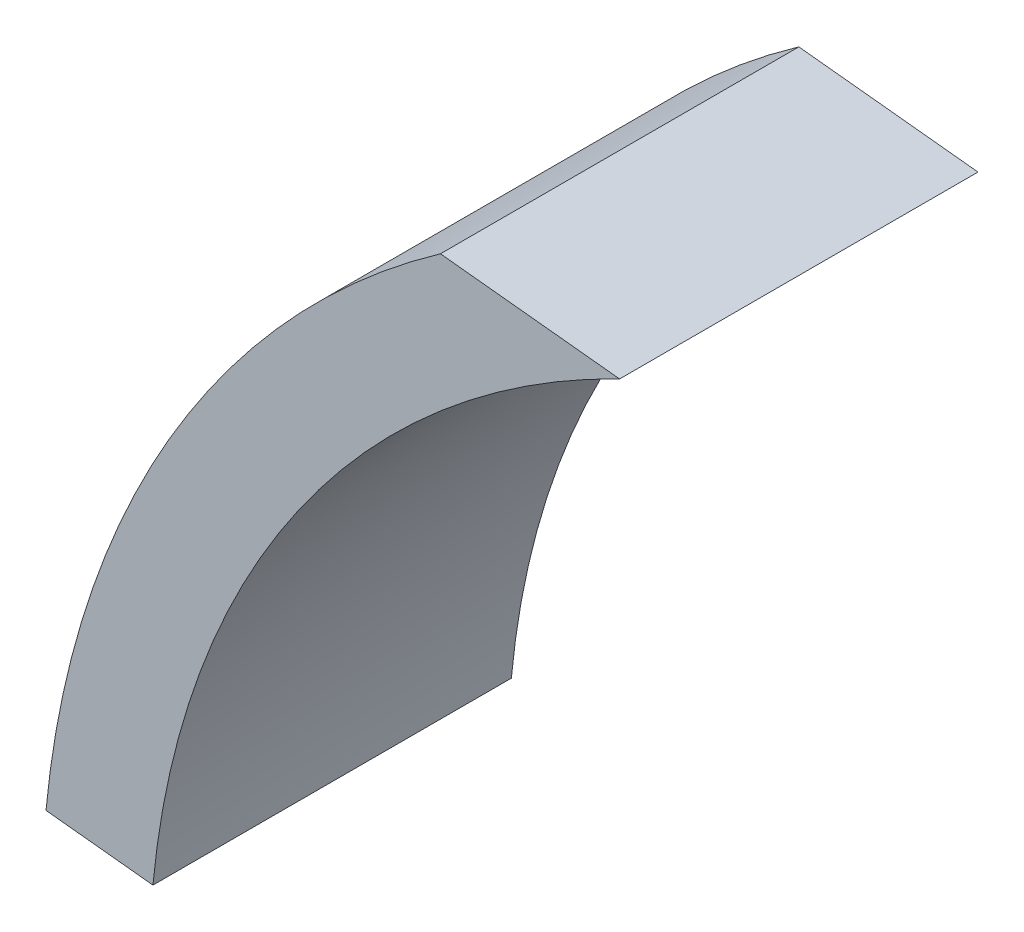
ISO-10303-21;
HEADER;
FILE_DESCRIPTION(('STEP AP214'),'2;1');
FILE_NAME('part.step','',(''),(''),'','','');
FILE_SCHEMA(('AUTOMOTIVE_DESIGN { 1 0 10303 214 1 1 1 1 }'));
ENDSEC;
DATA;
#1=APPLICATION_CONTEXT('core data for automotive mechanical design processes');
#2=APPLICATION_PROTOCOL_DEFINITION('international standard','automotive_design',2000,#1);
#3=PRODUCT_CONTEXT('',#1,'mechanical');
#4=PRODUCT('Part','Part','',(#3));
#5=PRODUCT_RELATED_PRODUCT_CATEGORY('part','',(#4));
#6=PRODUCT_DEFINITION_FORMATION('','',#4);
#7=PRODUCT_DEFINITION_CONTEXT('part definition',#1,'design');
#8=PRODUCT_DEFINITION('design','',#6,#7);
#9=PRODUCT_DEFINITION_SHAPE('','',#8);
#10=(LENGTH_UNIT() NAMED_UNIT(*) SI_UNIT(.MILLI.,.METRE.));
#11=(NAMED_UNIT(*) PLANE_ANGLE_UNIT() SI_UNIT($,.RADIAN.));
#12=(NAMED_UNIT(*) SI_UNIT($,.STERADIAN.) SOLID_ANGLE_UNIT());
#13=UNCERTAINTY_MEASURE_WITH_UNIT(LENGTH_MEASURE(1.E-05),#10,'distance_accuracy_value','');
#14=(GEOMETRIC_REPRESENTATION_CONTEXT(3) GLOBAL_UNCERTAINTY_ASSIGNED_CONTEXT((#13)) GLOBAL_UNIT_ASSIGNED_CONTEXT((#10,
#11,#12)) REPRESENTATION_CONTEXT('',''));
#15=CARTESIAN_POINT('',(0.,0.,0.));
#16=DIRECTION('',(0.,0.,1.));
#17=DIRECTION('',(1.,0.,0.));
#18=AXIS2_PLACEMENT_3D('',#15,#16,#17);
#19=CARTESIAN_POINT('',(0.,0.,6.15));
#20=DIRECTION('',(0.,0.,1.));
#21=DIRECTION('',(1.,0.,0.));
#22=AXIS2_PLACEMENT_3D('',#19,#20,#21);
#23=PLANE('',#22);
#24=DIRECTION('',(0.994521895368273,-0.104528463267654,0.));
#25=VECTOR('',#24,1.);
#26=CARTESIAN_POINT('',(0.826031073261367,7.85916068152122,6.15));
#27=LINE('',#26,#25);
#28=CARTESIAN_POINT('',(-6.04994012159409,8.58185437566532,6.15));
#29=VERTEX_POINT('',#28);
#30=CARTESIAN_POINT('',(-4.05029811740699,8.37168353201012,6.15));
#31=VERTEX_POINT('',#30);
#32=EDGE_CURVE('E50',#29,#31,#27,.T.);
#33=ORIENTED_EDGE('',*,*,#32,.F.);
#34=CARTESIAN_POINT('',(0.,0.,6.15));
#35=DIRECTION('',(0.,0.,1.));
#36=DIRECTION('',(1.,0.,0.));
#37=AXIS2_PLACEMENT_3D('',#34,#35,#36);
#38=CIRCLE('',#37,10.5);
#39=CARTESIAN_POINT('',(-10.452225874404,1.00048701662726,6.15));
#40=VERTEX_POINT('',#39);
#41=EDGE_CURVE('E112',#29,#40,#38,.T.);
#42=ORIENTED_EDGE('',*,*,#41,.T.);
#43=DIRECTION('',(-0.994521895368273,0.104528463267654,0.));
#44=VECTOR('',#43,1.);
#45=CARTESIAN_POINT('',(-0.0101966328798677,-0.0970144814249705,6.15));
#46=LINE('',#45,#44);
#47=CARTESIAN_POINT('',(-9.25874144728863,0.875046748613809,6.15));
#48=VERTEX_POINT('',#47);
#49=EDGE_CURVE('E116',#48,#40,#46,.T.);
#50=ORIENTED_EDGE('',*,*,#49,.F.);
#51=CARTESIAN_POINT('',(0.,0.,6.15));
#52=DIRECTION('',(0.,0.,-1.));
#53=DIRECTION('',(1.,0.,0.));
#54=AXIS2_PLACEMENT_3D('',#51,#52,#53);
#55=CIRCLE('',#54,9.3);
#56=EDGE_CURVE('E89',#48,#31,#55,.T.);
#57=ORIENTED_EDGE('',*,*,#56,.T.);
#58=EDGE_LOOP('',(#33,#42,#50,#57));
#59=FACE_BOUND('',#58,.T.);
#60=ADVANCED_FACE('F41',(#59),#23,.T.);
#61=CARTESIAN_POINT('',(0.,0.,6.15));
#62=DIRECTION('',(0.,0.,-1.));
#63=DIRECTION('',(-1.,0.,0.));
#64=AXIS2_PLACEMENT_3D('',#61,#62,#63);
#65=CYLINDRICAL_SURFACE('',#64,10.5);
#66=ORIENTED_EDGE('',*,*,#41,.F.);
#67=DIRECTION('',(0.,0.,-1.));
#68=VECTOR('',#67,1.);
#69=CARTESIAN_POINT('',(-6.04994012159409,8.58185437566533,6.15));
#70=LINE('',#69,#68);
#71=CARTESIAN_POINT('',(-6.04994012159409,8.58185437566532,2.15));
#72=VERTEX_POINT('',#71);
#73=EDGE_CURVE('E100',#29,#72,#70,.T.);
#74=ORIENTED_EDGE('',*,*,#73,.T.);
#75=CARTESIAN_POINT('',(0.,0.,2.15));
#76=DIRECTION('',(0.,0.,1.));
#77=DIRECTION('',(1.,0.,0.));
#78=AXIS2_PLACEMENT_3D('',#75,#76,#77);
#79=CIRCLE('',#78,10.5);
#80=CARTESIAN_POINT('',(-10.452225874404,1.00048701662726,2.15));
#81=VERTEX_POINT('',#80);
#82=EDGE_CURVE('E11',#72,#81,#79,.T.);
#83=ORIENTED_EDGE('',*,*,#82,.T.);
#84=DIRECTION('',(0.,0.,-1.));
#85=VECTOR('',#84,1.);
#86=CARTESIAN_POINT('',(-10.452225874404,1.00048701662726,6.15));
#87=LINE('',#86,#85);
#88=EDGE_CURVE('E94',#81,#40,#87,.F.);
#89=ORIENTED_EDGE('',*,*,#88,.T.);
#90=EDGE_LOOP('',(#66,#74,#83,#89));
#91=FACE_BOUND('',#90,.T.);
#92=ADVANCED_FACE('F125',(#91),#65,.T.);
#93=CARTESIAN_POINT('',(0.,0.,6.15));
#94=DIRECTION('',(0.,0.,-1.));
#95=DIRECTION('',(-1.,0.,0.));
#96=AXIS2_PLACEMENT_3D('',#93,#94,#95);
#97=CYLINDRICAL_SURFACE('',#96,9.3);
#98=CARTESIAN_POINT('',(0.,0.,2.15));
#99=DIRECTION('',(0.,0.,1.));
#100=DIRECTION('',(1.,0.,0.));
#101=AXIS2_PLACEMENT_3D('',#98,#99,#100);
#102=CIRCLE('',#101,9.3);
#103=CARTESIAN_POINT('',(-9.25874144728863,0.875046748613807,2.15));
#104=VERTEX_POINT('',#103);
#105=CARTESIAN_POINT('',(-4.05029811740699,8.37168353201012,2.15));
#106=VERTEX_POINT('',#105);
#107=EDGE_CURVE('E82',#104,#106,#102,.F.);
#108=ORIENTED_EDGE('',*,*,#107,.T.);
#109=DIRECTION('',(0.,0.,-1.));
#110=VECTOR('',#109,1.);
#111=CARTESIAN_POINT('',(-4.05029811740699,8.37168353201012,6.15));
#112=LINE('',#111,#110);
#113=EDGE_CURVE('E90',#106,#31,#112,.F.);
#114=ORIENTED_EDGE('',*,*,#113,.T.);
#115=ORIENTED_EDGE('',*,*,#56,.F.);
#116=DIRECTION('',(0.,0.,-1.));
#117=VECTOR('',#116,1.);
#118=CARTESIAN_POINT('',(-9.25874144728863,0.875046748613809,6.15));
#119=LINE('',#118,#117);
#120=EDGE_CURVE('E57',#48,#104,#119,.T.);
#121=ORIENTED_EDGE('',*,*,#120,.T.);
#122=EDGE_LOOP('',(#108,#114,#115,#121));
#123=FACE_BOUND('',#122,.T.);
#124=ADVANCED_FACE('F43',(#123),#97,.F.);
#125=CARTESIAN_POINT('',(11.1544143545613,6.77360385520938,6.15));
#126=DIRECTION('',(-0.104528463267654,-0.994521895368273,0.));
#127=DIRECTION('',(0.994521895368273,-0.104528463267654,0.));
#128=AXIS2_PLACEMENT_3D('',#125,#126,#127);
#129=PLANE('',#128);
#130=DIRECTION('',(-0.994521895368273,0.104528463267654,0.));
#131=VECTOR('',#130,1.);
#132=CARTESIAN_POINT('',(11.1544143545613,6.77360385520938,2.15));
#133=LINE('',#132,#131);
#134=EDGE_CURVE('E85',#106,#72,#133,.T.);
#135=ORIENTED_EDGE('',*,*,#134,.T.);
#136=ORIENTED_EDGE('',*,*,#73,.F.);
#137=ORIENTED_EDGE('',*,*,#32,.T.);
#138=ORIENTED_EDGE('',*,*,#113,.F.);
#139=EDGE_LOOP('',(#135,#136,#137,#138));
#140=FACE_BOUND('',#139,.T.);
#141=ADVANCED_FACE('F121',(#140),#129,.F.);
#142=CARTESIAN_POINT('',(10.3181866484201,-1.18257130773681,6.15));
#143=DIRECTION('',(0.104528463267654,0.994521895368273,0.));
#144=DIRECTION('',(-0.994521895368273,0.104528463267654,0.));
#145=AXIS2_PLACEMENT_3D('',#142,#143,#144);
#146=PLANE('',#145);
#147=ORIENTED_EDGE('',*,*,#49,.T.);
#148=ORIENTED_EDGE('',*,*,#88,.F.);
#149=DIRECTION('',(-0.994521895368273,0.104528463267654,0.));
#150=VECTOR('',#149,1.);
#151=CARTESIAN_POINT('',(10.3181866484201,-1.18257130773681,2.15));
#152=LINE('',#151,#150);
#153=EDGE_CURVE('E84',#104,#81,#152,.T.);
#154=ORIENTED_EDGE('',*,*,#153,.F.);
#155=ORIENTED_EDGE('',*,*,#120,.F.);
#156=EDGE_LOOP('',(#147,#148,#154,#155));
#157=FACE_BOUND('',#156,.T.);
#158=ADVANCED_FACE('F92',(#157),#146,.F.);
#159=CARTESIAN_POINT('',(10.3181866484201,-1.18257130773681,2.15));
#160=DIRECTION('',(0.,0.,1.));
#161=DIRECTION('',(1.,0.,0.));
#162=AXIS2_PLACEMENT_3D('',#159,#160,#161);
#163=PLANE('',#162);
#164=ORIENTED_EDGE('',*,*,#153,.T.);
#165=ORIENTED_EDGE('',*,*,#82,.F.);
#166=ORIENTED_EDGE('',*,*,#134,.F.);
#167=ORIENTED_EDGE('',*,*,#107,.F.);
#168=EDGE_LOOP('',(#164,#165,#166,#167));
#169=FACE_BOUND('',#168,.T.);
#170=ADVANCED_FACE('F83',(#169),#163,.F.);
#171=CLOSED_SHELL('',(#60,#92,#124,#141,#158,#170));
#172=MANIFOLD_SOLID_BREP('B2',#171);
#173=ADVANCED_BREP_SHAPE_REPRESENTATION('',(#18,#172),#14);
#174=SHAPE_DEFINITION_REPRESENTATION(#9,#173);
ENDSEC;
END-ISO-10303-21;
